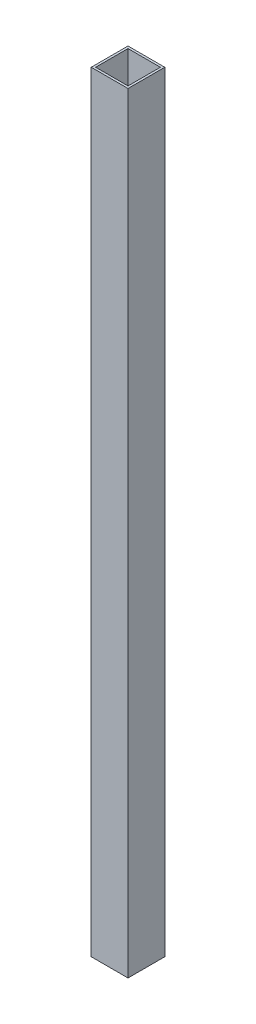
ISO-10303-21;
HEADER;
FILE_DESCRIPTION(('STEP AP214'),'2;1');
FILE_NAME('part.step','',(''),(''),'','','');
FILE_SCHEMA(('AUTOMOTIVE_DESIGN { 1 0 10303 214 1 1 1 1 }'));
ENDSEC;
DATA;
#1=APPLICATION_CONTEXT('core data for automotive mechanical design processes');
#2=APPLICATION_PROTOCOL_DEFINITION('international standard','automotive_design',2000,#1);
#3=PRODUCT_CONTEXT('',#1,'mechanical');
#4=PRODUCT('Part','Part','',(#3));
#5=PRODUCT_RELATED_PRODUCT_CATEGORY('part','',(#4));
#6=PRODUCT_DEFINITION_FORMATION('','',#4);
#7=PRODUCT_DEFINITION_CONTEXT('part definition',#1,'design');
#8=PRODUCT_DEFINITION('design','',#6,#7);
#9=PRODUCT_DEFINITION_SHAPE('','',#8);
#10=(LENGTH_UNIT() NAMED_UNIT(*) SI_UNIT(.MILLI.,.METRE.));
#11=(NAMED_UNIT(*) PLANE_ANGLE_UNIT() SI_UNIT($,.RADIAN.));
#12=(NAMED_UNIT(*) SI_UNIT($,.STERADIAN.) SOLID_ANGLE_UNIT());
#13=UNCERTAINTY_MEASURE_WITH_UNIT(LENGTH_MEASURE(1.E-05),#10,'distance_accuracy_value','');
#14=(GEOMETRIC_REPRESENTATION_CONTEXT(3) GLOBAL_UNCERTAINTY_ASSIGNED_CONTEXT((#13)) GLOBAL_UNIT_ASSIGNED_CONTEXT((#10,
#11,#12)) REPRESENTATION_CONTEXT('',''));
#15=CARTESIAN_POINT('',(0.,0.,0.));
#16=DIRECTION('',(0.,0.,1.));
#17=DIRECTION('',(1.,0.,0.));
#18=AXIS2_PLACEMENT_3D('',#15,#16,#17);
#19=CARTESIAN_POINT('',(0.,1047.,0.));
#20=DIRECTION('',(0.,-1.,0.));
#21=DIRECTION('',(0.,0.,-1.));
#22=AXIS2_PLACEMENT_3D('',#19,#20,#21);
#23=PLANE('',#22);
#24=DIRECTION('',(0.,0.,1.));
#25=VECTOR('',#24,1.);
#26=CARTESIAN_POINT('',(0.,1047.,0.));
#27=LINE('',#26,#25);
#28=CARTESIAN_POINT('',(0.,1047.,-50.));
#29=VERTEX_POINT('',#28);
#30=CARTESIAN_POINT('',(0.,1047.,0.));
#31=VERTEX_POINT('',#30);
#32=EDGE_CURVE('E133',#29,#31,#27,.T.);
#33=ORIENTED_EDGE('',*,*,#32,.T.);
#34=DIRECTION('',(1.,0.,0.));
#35=VECTOR('',#34,1.);
#36=CARTESIAN_POINT('',(0.,1047.,0.));
#37=LINE('',#36,#35);
#38=CARTESIAN_POINT('',(50.,1047.,0.));
#39=VERTEX_POINT('',#38);
#40=EDGE_CURVE('E136',#31,#39,#37,.T.);
#41=ORIENTED_EDGE('',*,*,#40,.T.);
#42=DIRECTION('',(0.,0.,-1.));
#43=VECTOR('',#42,1.);
#44=CARTESIAN_POINT('',(50.,1047.,0.));
#45=LINE('',#44,#43);
#46=CARTESIAN_POINT('',(50.,1047.,-50.));
#47=VERTEX_POINT('',#46);
#48=EDGE_CURVE('E139',#39,#47,#45,.T.);
#49=ORIENTED_EDGE('',*,*,#48,.T.);
#50=DIRECTION('',(-1.,0.,0.));
#51=VECTOR('',#50,1.);
#52=CARTESIAN_POINT('',(0.,1047.,-50.));
#53=LINE('',#52,#51);
#54=EDGE_CURVE('E141',#47,#29,#53,.T.);
#55=ORIENTED_EDGE('',*,*,#54,.T.);
#56=EDGE_LOOP('',(#33,#41,#49,#55));
#57=FACE_BOUND('',#56,.T.);
#58=DIRECTION('',(0.,0.,1.));
#59=VECTOR('',#58,1.);
#60=CARTESIAN_POINT('',(3.,1047.,-3.));
#61=LINE('',#60,#59);
#62=CARTESIAN_POINT('',(3.,1047.,-47.));
#63=VERTEX_POINT('',#62);
#64=CARTESIAN_POINT('',(3.,1047.,-3.));
#65=VERTEX_POINT('',#64);
#66=EDGE_CURVE('E97',#63,#65,#61,.T.);
#67=ORIENTED_EDGE('',*,*,#66,.F.);
#68=DIRECTION('',(-1.,0.,0.));
#69=VECTOR('',#68,1.);
#70=CARTESIAN_POINT('',(3.,1047.,-47.));
#71=LINE('',#70,#69);
#72=CARTESIAN_POINT('',(47.,1047.,-47.));
#73=VERTEX_POINT('',#72);
#74=EDGE_CURVE('E119',#73,#63,#71,.T.);
#75=ORIENTED_EDGE('',*,*,#74,.F.);
#76=DIRECTION('',(0.,0.,-1.));
#77=VECTOR('',#76,1.);
#78=CARTESIAN_POINT('',(47.,1047.,-3.));
#79=LINE('',#78,#77);
#80=CARTESIAN_POINT('',(47.,1047.,-3.));
#81=VERTEX_POINT('',#80);
#82=EDGE_CURVE('E117',#81,#73,#79,.T.);
#83=ORIENTED_EDGE('',*,*,#82,.F.);
#84=DIRECTION('',(1.,0.,0.));
#85=VECTOR('',#84,1.);
#86=CARTESIAN_POINT('',(3.,1047.,-3.));
#87=LINE('',#86,#85);
#88=EDGE_CURVE('E105',#65,#81,#87,.T.);
#89=ORIENTED_EDGE('',*,*,#88,.F.);
#90=EDGE_LOOP('',(#67,#75,#83,#89));
#91=FACE_BOUND('',#90,.T.);
#92=ADVANCED_FACE('F32',(#57,#91),#23,.F.);
#93=CARTESIAN_POINT('',(0.,0.,0.));
#94=DIRECTION('',(0.,-1.,0.));
#95=DIRECTION('',(0.,0.,-1.));
#96=AXIS2_PLACEMENT_3D('',#93,#94,#95);
#97=PLANE('',#96);
#98=DIRECTION('',(0.,0.,1.));
#99=VECTOR('',#98,1.);
#100=CARTESIAN_POINT('',(0.,0.,0.));
#101=LINE('',#100,#99);
#102=CARTESIAN_POINT('',(0.,0.,-50.));
#103=VERTEX_POINT('',#102);
#104=CARTESIAN_POINT('',(0.,0.,0.));
#105=VERTEX_POINT('',#104);
#106=EDGE_CURVE('E113',#103,#105,#101,.T.);
#107=ORIENTED_EDGE('',*,*,#106,.F.);
#108=DIRECTION('',(-1.,0.,0.));
#109=VECTOR('',#108,1.);
#110=CARTESIAN_POINT('',(0.,0.,-50.));
#111=LINE('',#110,#109);
#112=CARTESIAN_POINT('',(50.,0.,-50.));
#113=VERTEX_POINT('',#112);
#114=EDGE_CURVE('E137',#113,#103,#111,.T.);
#115=ORIENTED_EDGE('',*,*,#114,.F.);
#116=DIRECTION('',(0.,0.,-1.));
#117=VECTOR('',#116,1.);
#118=CARTESIAN_POINT('',(50.,0.,0.));
#119=LINE('',#118,#117);
#120=CARTESIAN_POINT('',(50.,0.,0.));
#121=VERTEX_POINT('',#120);
#122=EDGE_CURVE('E148',#121,#113,#119,.T.);
#123=ORIENTED_EDGE('',*,*,#122,.F.);
#124=DIRECTION('',(1.,0.,0.));
#125=VECTOR('',#124,1.);
#126=CARTESIAN_POINT('',(0.,0.,0.));
#127=LINE('',#126,#125);
#128=EDGE_CURVE('E146',#105,#121,#127,.T.);
#129=ORIENTED_EDGE('',*,*,#128,.F.);
#130=EDGE_LOOP('',(#107,#115,#123,#129));
#131=FACE_BOUND('',#130,.T.);
#132=DIRECTION('',(-1.,0.,0.));
#133=VECTOR('',#132,1.);
#134=CARTESIAN_POINT('',(3.,0.,-47.));
#135=LINE('',#134,#133);
#136=CARTESIAN_POINT('',(47.,0.,-47.));
#137=VERTEX_POINT('',#136);
#138=CARTESIAN_POINT('',(3.,0.,-47.));
#139=VERTEX_POINT('',#138);
#140=EDGE_CURVE('E106',#137,#139,#135,.T.);
#141=ORIENTED_EDGE('',*,*,#140,.T.);
#142=DIRECTION('',(0.,0.,1.));
#143=VECTOR('',#142,1.);
#144=CARTESIAN_POINT('',(3.,0.,-3.));
#145=LINE('',#144,#143);
#146=CARTESIAN_POINT('',(3.,0.,-3.));
#147=VERTEX_POINT('',#146);
#148=EDGE_CURVE('E55',#139,#147,#145,.T.);
#149=ORIENTED_EDGE('',*,*,#148,.T.);
#150=DIRECTION('',(1.,0.,0.));
#151=VECTOR('',#150,1.);
#152=CARTESIAN_POINT('',(3.,0.,-3.));
#153=LINE('',#152,#151);
#154=CARTESIAN_POINT('',(47.,0.,-3.));
#155=VERTEX_POINT('',#154);
#156=EDGE_CURVE('E112',#147,#155,#153,.T.);
#157=ORIENTED_EDGE('',*,*,#156,.T.);
#158=DIRECTION('',(0.,0.,-1.));
#159=VECTOR('',#158,1.);
#160=CARTESIAN_POINT('',(47.,0.,-3.));
#161=LINE('',#160,#159);
#162=EDGE_CURVE('E125',#155,#137,#161,.T.);
#163=ORIENTED_EDGE('',*,*,#162,.T.);
#164=EDGE_LOOP('',(#141,#149,#157,#163));
#165=FACE_BOUND('',#164,.T.);
#166=ADVANCED_FACE('F166',(#131,#165),#97,.T.);
#167=CARTESIAN_POINT('',(0.,1047.,0.));
#168=DIRECTION('',(1.,0.,0.));
#169=DIRECTION('',(0.,0.,-1.));
#170=AXIS2_PLACEMENT_3D('',#167,#168,#169);
#171=PLANE('',#170);
#172=ORIENTED_EDGE('',*,*,#106,.T.);
#173=DIRECTION('',(0.,-1.,0.));
#174=VECTOR('',#173,1.);
#175=CARTESIAN_POINT('',(0.,1047.,0.));
#176=LINE('',#175,#174);
#177=EDGE_CURVE('E11',#31,#105,#176,.T.);
#178=ORIENTED_EDGE('',*,*,#177,.F.);
#179=ORIENTED_EDGE('',*,*,#32,.F.);
#180=DIRECTION('',(0.,-1.,0.));
#181=VECTOR('',#180,1.);
#182=CARTESIAN_POINT('',(0.,1047.,-50.));
#183=LINE('',#182,#181);
#184=EDGE_CURVE('E143',#29,#103,#183,.T.);
#185=ORIENTED_EDGE('',*,*,#184,.T.);
#186=EDGE_LOOP('',(#172,#178,#179,#185));
#187=FACE_BOUND('',#186,.T.);
#188=ADVANCED_FACE('F34',(#187),#171,.F.);
#189=CARTESIAN_POINT('',(0.,1047.,0.));
#190=DIRECTION('',(0.,0.,-1.));
#191=DIRECTION('',(-1.,0.,0.));
#192=AXIS2_PLACEMENT_3D('',#189,#190,#191);
#193=PLANE('',#192);
#194=ORIENTED_EDGE('',*,*,#128,.T.);
#195=DIRECTION('',(0.,-1.,0.));
#196=VECTOR('',#195,1.);
#197=CARTESIAN_POINT('',(50.,1047.,0.));
#198=LINE('',#197,#196);
#199=EDGE_CURVE('E40',#39,#121,#198,.T.);
#200=ORIENTED_EDGE('',*,*,#199,.F.);
#201=ORIENTED_EDGE('',*,*,#40,.F.);
#202=ORIENTED_EDGE('',*,*,#177,.T.);
#203=EDGE_LOOP('',(#194,#200,#201,#202));
#204=FACE_BOUND('',#203,.T.);
#205=ADVANCED_FACE('F176',(#204),#193,.F.);
#206=CARTESIAN_POINT('',(50.,1047.,0.));
#207=DIRECTION('',(-1.,0.,0.));
#208=DIRECTION('',(0.,0.,1.));
#209=AXIS2_PLACEMENT_3D('',#206,#207,#208);
#210=PLANE('',#209);
#211=ORIENTED_EDGE('',*,*,#122,.T.);
#212=DIRECTION('',(0.,-1.,0.));
#213=VECTOR('',#212,1.);
#214=CARTESIAN_POINT('',(50.,1047.,-50.));
#215=LINE('',#214,#213);
#216=EDGE_CURVE('E153',#47,#113,#215,.T.);
#217=ORIENTED_EDGE('',*,*,#216,.F.);
#218=ORIENTED_EDGE('',*,*,#48,.F.);
#219=ORIENTED_EDGE('',*,*,#199,.T.);
#220=EDGE_LOOP('',(#211,#217,#218,#219));
#221=FACE_BOUND('',#220,.T.);
#222=ADVANCED_FACE('F160',(#221),#210,.F.);
#223=CARTESIAN_POINT('',(0.,1047.,-50.));
#224=DIRECTION('',(0.,0.,1.));
#225=DIRECTION('',(1.,0.,0.));
#226=AXIS2_PLACEMENT_3D('',#223,#224,#225);
#227=PLANE('',#226);
#228=ORIENTED_EDGE('',*,*,#114,.T.);
#229=ORIENTED_EDGE('',*,*,#184,.F.);
#230=ORIENTED_EDGE('',*,*,#54,.F.);
#231=ORIENTED_EDGE('',*,*,#216,.T.);
#232=EDGE_LOOP('',(#228,#229,#230,#231));
#233=FACE_BOUND('',#232,.T.);
#234=ADVANCED_FACE('F170',(#233),#227,.F.);
#235=CARTESIAN_POINT('',(3.,1047.,-3.));
#236=DIRECTION('',(1.,0.,0.));
#237=DIRECTION('',(0.,0.,-1.));
#238=AXIS2_PLACEMENT_3D('',#235,#236,#237);
#239=PLANE('',#238);
#240=ORIENTED_EDGE('',*,*,#148,.F.);
#241=DIRECTION('',(0.,-1.,0.));
#242=VECTOR('',#241,1.);
#243=CARTESIAN_POINT('',(3.,1047.,-47.));
#244=LINE('',#243,#242);
#245=EDGE_CURVE('E101',#63,#139,#244,.T.);
#246=ORIENTED_EDGE('',*,*,#245,.F.);
#247=ORIENTED_EDGE('',*,*,#66,.T.);
#248=DIRECTION('',(0.,-1.,0.));
#249=VECTOR('',#248,1.);
#250=CARTESIAN_POINT('',(3.,1047.,-3.));
#251=LINE('',#250,#249);
#252=EDGE_CURVE('E100',#65,#147,#251,.T.);
#253=ORIENTED_EDGE('',*,*,#252,.T.);
#254=EDGE_LOOP('',(#240,#246,#247,#253));
#255=FACE_BOUND('',#254,.T.);
#256=ADVANCED_FACE('F99',(#255),#239,.T.);
#257=CARTESIAN_POINT('',(3.,1047.,-3.));
#258=DIRECTION('',(0.,0.,-1.));
#259=DIRECTION('',(-1.,0.,0.));
#260=AXIS2_PLACEMENT_3D('',#257,#258,#259);
#261=PLANE('',#260);
#262=ORIENTED_EDGE('',*,*,#156,.F.);
#263=ORIENTED_EDGE('',*,*,#252,.F.);
#264=ORIENTED_EDGE('',*,*,#88,.T.);
#265=DIRECTION('',(0.,-1.,0.));
#266=VECTOR('',#265,1.);
#267=CARTESIAN_POINT('',(47.,1047.,-3.));
#268=LINE('',#267,#266);
#269=EDGE_CURVE('E114',#81,#155,#268,.T.);
#270=ORIENTED_EDGE('',*,*,#269,.T.);
#271=EDGE_LOOP('',(#262,#263,#264,#270));
#272=FACE_BOUND('',#271,.T.);
#273=ADVANCED_FACE('F109',(#272),#261,.T.);
#274=CARTESIAN_POINT('',(47.,1047.,-3.));
#275=DIRECTION('',(-1.,0.,0.));
#276=DIRECTION('',(0.,0.,1.));
#277=AXIS2_PLACEMENT_3D('',#274,#275,#276);
#278=PLANE('',#277);
#279=ORIENTED_EDGE('',*,*,#162,.F.);
#280=ORIENTED_EDGE('',*,*,#269,.F.);
#281=ORIENTED_EDGE('',*,*,#82,.T.);
#282=DIRECTION('',(0.,-1.,0.));
#283=VECTOR('',#282,1.);
#284=CARTESIAN_POINT('',(47.,1047.,-47.));
#285=LINE('',#284,#283);
#286=EDGE_CURVE('E47',#73,#137,#285,.T.);
#287=ORIENTED_EDGE('',*,*,#286,.T.);
#288=EDGE_LOOP('',(#279,#280,#281,#287));
#289=FACE_BOUND('',#288,.T.);
#290=ADVANCED_FACE('F199',(#289),#278,.T.);
#291=CARTESIAN_POINT('',(3.,1047.,-47.));
#292=DIRECTION('',(0.,0.,1.));
#293=DIRECTION('',(1.,0.,0.));
#294=AXIS2_PLACEMENT_3D('',#291,#292,#293);
#295=PLANE('',#294);
#296=ORIENTED_EDGE('',*,*,#140,.F.);
#297=ORIENTED_EDGE('',*,*,#286,.F.);
#298=ORIENTED_EDGE('',*,*,#74,.T.);
#299=ORIENTED_EDGE('',*,*,#245,.T.);
#300=EDGE_LOOP('',(#296,#297,#298,#299));
#301=FACE_BOUND('',#300,.T.);
#302=ADVANCED_FACE('F203',(#301),#295,.T.);
#303=CLOSED_SHELL('',(#92,#166,#188,#205,#222,#234,#256,#273,#290,#302));
#304=MANIFOLD_SOLID_BREP('B2',#303);
#305=ADVANCED_BREP_SHAPE_REPRESENTATION('',(#18,#304),#14);
#306=SHAPE_DEFINITION_REPRESENTATION(#9,#305);
ENDSEC;
END-ISO-10303-21;
